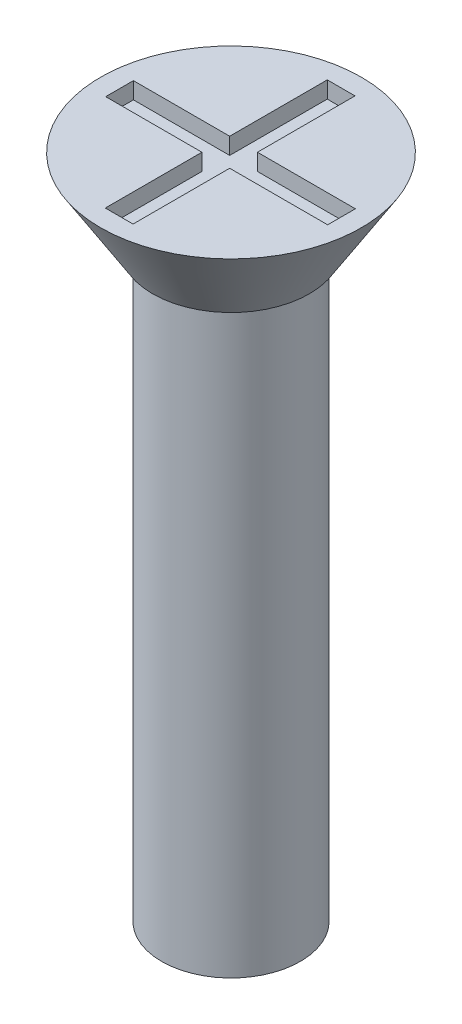
ISO-10303-21;
HEADER;
FILE_DESCRIPTION(('STEP AP214'),'2;1');
FILE_NAME('part.step','',(''),(''),'','','');
FILE_SCHEMA(('AUTOMOTIVE_DESIGN { 1 0 10303 214 1 1 1 1 }'));
ENDSEC;
DATA;
#1=APPLICATION_CONTEXT('core data for automotive mechanical design processes');
#2=APPLICATION_PROTOCOL_DEFINITION('international standard','automotive_design',2000,#1);
#3=PRODUCT_CONTEXT('',#1,'mechanical');
#4=PRODUCT('Part','Part','',(#3));
#5=PRODUCT_RELATED_PRODUCT_CATEGORY('part','',(#4));
#6=PRODUCT_DEFINITION_FORMATION('','',#4);
#7=PRODUCT_DEFINITION_CONTEXT('part definition',#1,'design');
#8=PRODUCT_DEFINITION('design','',#6,#7);
#9=PRODUCT_DEFINITION_SHAPE('','',#8);
#10=(LENGTH_UNIT() NAMED_UNIT(*) SI_UNIT(.MILLI.,.METRE.));
#11=(NAMED_UNIT(*) PLANE_ANGLE_UNIT() SI_UNIT($,.RADIAN.));
#12=(NAMED_UNIT(*) SI_UNIT($,.STERADIAN.) SOLID_ANGLE_UNIT());
#13=UNCERTAINTY_MEASURE_WITH_UNIT(LENGTH_MEASURE(1.E-05),#10,'distance_accuracy_value','');
#14=(GEOMETRIC_REPRESENTATION_CONTEXT(3) GLOBAL_UNCERTAINTY_ASSIGNED_CONTEXT((#13)) GLOBAL_UNIT_ASSIGNED_CONTEXT((#10,
#11,#12)) REPRESENTATION_CONTEXT('',''));
#15=CARTESIAN_POINT('',(0.,0.,0.));
#16=DIRECTION('',(0.,0.,1.));
#17=DIRECTION('',(1.,0.,0.));
#18=AXIS2_PLACEMENT_3D('',#15,#16,#17);
#19=CARTESIAN_POINT('',(0.,12.,0.));
#20=DIRECTION('',(0.,1.,0.));
#21=DIRECTION('',(0.,0.,1.));
#22=AXIS2_PLACEMENT_3D('',#19,#20,#21);
#23=PLANE('',#22);
#24=CARTESIAN_POINT('',(0.,12.,0.));
#25=DIRECTION('',(0.,1.,0.));
#26=DIRECTION('',(0.,0.,1.));
#27=AXIS2_PLACEMENT_3D('',#24,#25,#26);
#28=CIRCLE('',#27,2.35);
#29=CARTESIAN_POINT('',(0.,12.,2.35));
#30=VERTEX_POINT('',#29);
#31=EDGE_CURVE('E192',#30,#30,#28,.T.);
#32=ORIENTED_EDGE('',*,*,#31,.T.);
#33=EDGE_LOOP('',(#32));
#34=FACE_BOUND('',#33,.T.);
#35=DIRECTION('',(1.,0.,0.));
#36=VECTOR('',#35,1.);
#37=CARTESIAN_POINT('',(0.,12.,-2.));
#38=LINE('',#37,#36);
#39=CARTESIAN_POINT('',(-0.265272843023468,12.,-2.));
#40=VERTEX_POINT('',#39);
#41=CARTESIAN_POINT('',(0.234727156976532,12.,-2.));
#42=VERTEX_POINT('',#41);
#43=EDGE_CURVE('E161',#40,#42,#38,.T.);
#44=ORIENTED_EDGE('',*,*,#43,.T.);
#45=DIRECTION('',(0.,0.,1.));
#46=VECTOR('',#45,1.);
#47=CARTESIAN_POINT('',(0.234727156976532,12.,0.));
#48=LINE('',#47,#46);
#49=CARTESIAN_POINT('',(0.234727156976532,12.,-0.241621514992573));
#50=VERTEX_POINT('',#49);
#51=EDGE_CURVE('E48',#42,#50,#48,.T.);
#52=ORIENTED_EDGE('',*,*,#51,.T.);
#53=DIRECTION('',(1.,0.,0.));
#54=VECTOR('',#53,1.);
#55=CARTESIAN_POINT('',(0.,12.,-0.241621514992573));
#56=LINE('',#55,#54);
#57=CARTESIAN_POINT('',(2.,12.,-0.241621514992573));
#58=VERTEX_POINT('',#57);
#59=EDGE_CURVE('E98',#50,#58,#56,.T.);
#60=ORIENTED_EDGE('',*,*,#59,.T.);
#61=DIRECTION('',(0.,0.,1.));
#62=VECTOR('',#61,1.);
#63=CARTESIAN_POINT('',(2.,12.,0.));
#64=LINE('',#63,#62);
#65=CARTESIAN_POINT('',(2.,12.,0.258378485007427));
#66=VERTEX_POINT('',#65);
#67=EDGE_CURVE('E186',#58,#66,#64,.T.);
#68=ORIENTED_EDGE('',*,*,#67,.T.);
#69=DIRECTION('',(1.,0.,0.));
#70=VECTOR('',#69,1.);
#71=CARTESIAN_POINT('',(0.,12.,0.258378485007427));
#72=LINE('',#71,#70);
#73=CARTESIAN_POINT('',(0.234727156976532,12.,0.258378485007427));
#74=VERTEX_POINT('',#73);
#75=EDGE_CURVE('E145',#74,#66,#72,.T.);
#76=ORIENTED_EDGE('',*,*,#75,.F.);
#77=DIRECTION('',(0.,0.,1.));
#78=VECTOR('',#77,1.);
#79=CARTESIAN_POINT('',(0.234727156976532,12.,0.));
#80=LINE('',#79,#78);
#81=CARTESIAN_POINT('',(0.234727156976533,12.,2.));
#82=VERTEX_POINT('',#81);
#83=EDGE_CURVE('E182',#74,#82,#80,.T.);
#84=ORIENTED_EDGE('',*,*,#83,.T.);
#85=DIRECTION('',(1.,0.,0.));
#86=VECTOR('',#85,1.);
#87=CARTESIAN_POINT('',(0.,12.,2.));
#88=LINE('',#87,#86);
#89=CARTESIAN_POINT('',(-0.265272843023467,12.,2.));
#90=VERTEX_POINT('',#89);
#91=EDGE_CURVE('E179',#90,#82,#88,.T.);
#92=ORIENTED_EDGE('',*,*,#91,.F.);
#93=DIRECTION('',(0.,0.,1.));
#94=VECTOR('',#93,1.);
#95=CARTESIAN_POINT('',(-0.265272843023468,12.,0.));
#96=LINE('',#95,#94);
#97=CARTESIAN_POINT('',(-0.265272843023468,12.,0.258378485007427));
#98=VERTEX_POINT('',#97);
#99=EDGE_CURVE('E176',#98,#90,#96,.T.);
#100=ORIENTED_EDGE('',*,*,#99,.F.);
#101=DIRECTION('',(1.,0.,0.));
#102=VECTOR('',#101,1.);
#103=CARTESIAN_POINT('',(0.,12.,0.258378485007427));
#104=LINE('',#103,#102);
#105=CARTESIAN_POINT('',(-2.,12.,0.258378485007427));
#106=VERTEX_POINT('',#105);
#107=EDGE_CURVE('E173',#106,#98,#104,.T.);
#108=ORIENTED_EDGE('',*,*,#107,.F.);
#109=DIRECTION('',(0.,0.,1.));
#110=VECTOR('',#109,1.);
#111=CARTESIAN_POINT('',(-2.,12.,0.));
#112=LINE('',#111,#110);
#113=CARTESIAN_POINT('',(-2.,12.,-0.241621514992573));
#114=VERTEX_POINT('',#113);
#115=EDGE_CURVE('E170',#114,#106,#112,.T.);
#116=ORIENTED_EDGE('',*,*,#115,.F.);
#117=DIRECTION('',(1.,0.,0.));
#118=VECTOR('',#117,1.);
#119=CARTESIAN_POINT('',(0.,12.,-0.241621514992573));
#120=LINE('',#119,#118);
#121=CARTESIAN_POINT('',(-0.265272843023468,12.,-0.241621514992573));
#122=VERTEX_POINT('',#121);
#123=EDGE_CURVE('E167',#114,#122,#120,.T.);
#124=ORIENTED_EDGE('',*,*,#123,.T.);
#125=DIRECTION('',(0.,0.,1.));
#126=VECTOR('',#125,1.);
#127=CARTESIAN_POINT('',(-0.265272843023468,12.,0.));
#128=LINE('',#127,#126);
#129=EDGE_CURVE('E164',#40,#122,#128,.T.);
#130=ORIENTED_EDGE('',*,*,#129,.F.);
#131=EDGE_LOOP('',(#44,#52,#60,#68,#76,#84,#92,#100,#108,#116,#124,#130));
#132=FACE_BOUND('',#131,.T.);
#133=ADVANCED_FACE('F33',(#34,#132),#23,.T.);
#134=CARTESIAN_POINT('',(0.,12.,0.));
#135=DIRECTION('',(0.,-1.,0.));
#136=DIRECTION('',(0.,0.,-1.));
#137=AXIS2_PLACEMENT_3D('',#134,#135,#136);
#138=CYLINDRICAL_SURFACE('',#137,1.25);
#139=CARTESIAN_POINT('',(0.,0.,0.));
#140=DIRECTION('',(0.,1.,0.));
#141=DIRECTION('',(0.,0.,1.));
#142=AXIS2_PLACEMENT_3D('',#139,#140,#141);
#143=CIRCLE('',#142,1.25);
#144=CARTESIAN_POINT('',(0.,0.,1.25));
#145=VERTEX_POINT('',#144);
#146=EDGE_CURVE('E41',#145,#145,#143,.T.);
#147=ORIENTED_EDGE('',*,*,#146,.T.);
#148=EDGE_LOOP('',(#147));
#149=FACE_BOUND('',#148,.T.);
#150=CARTESIAN_POINT('',(0.,10.5,0.));
#151=DIRECTION('',(0.,1.,0.));
#152=DIRECTION('',(0.,0.,1.));
#153=AXIS2_PLACEMENT_3D('',#150,#151,#152);
#154=CIRCLE('',#153,1.25);
#155=CARTESIAN_POINT('',(0.,10.5,1.25));
#156=VERTEX_POINT('',#155);
#157=EDGE_CURVE('E11',#156,#156,#154,.T.);
#158=ORIENTED_EDGE('',*,*,#157,.F.);
#159=EDGE_LOOP('',(#158));
#160=FACE_BOUND('',#159,.T.);
#161=ADVANCED_FACE('F35',(#149,#160),#138,.T.);
#162=CARTESIAN_POINT('',(0.,0.,0.));
#163=DIRECTION('',(0.,1.,0.));
#164=DIRECTION('',(0.,0.,1.));
#165=AXIS2_PLACEMENT_3D('',#162,#163,#164);
#166=PLANE('',#165);
#167=ORIENTED_EDGE('',*,*,#146,.F.);
#168=EDGE_LOOP('',(#167));
#169=FACE_BOUND('',#168,.T.);
#170=ADVANCED_FACE('F219',(#169),#166,.F.);
#171=CARTESIAN_POINT('',(0.,12.,0.));
#172=DIRECTION('',(0.,1.,0.));
#173=DIRECTION('',(0.,0.,1.));
#174=AXIS2_PLACEMENT_3D('',#171,#172,#173);
#175=CONICAL_SURFACE('',#174,2.35,0.558505360638187);
#176=CARTESIAN_POINT('',(0.,10.5,0.));
#177=DIRECTION('',(0.,1.,0.));
#178=DIRECTION('',(0.,0.,1.));
#179=AXIS2_PLACEMENT_3D('',#176,#177,#178);
#180=CIRCLE('',#179,1.41269597213601);
#181=CARTESIAN_POINT('',(0.,10.5,1.41269597213601));
#182=VERTEX_POINT('',#181);
#183=EDGE_CURVE('E212',#182,#182,#180,.T.);
#184=ORIENTED_EDGE('',*,*,#183,.T.);
#185=EDGE_LOOP('',(#184));
#186=FACE_BOUND('',#185,.T.);
#187=ORIENTED_EDGE('',*,*,#31,.F.);
#188=EDGE_LOOP('',(#187));
#189=FACE_BOUND('',#188,.T.);
#190=ADVANCED_FACE('F221',(#186,#189),#175,.T.);
#191=CARTESIAN_POINT('',(0.,10.5,0.));
#192=DIRECTION('',(0.,1.,0.));
#193=DIRECTION('',(0.,0.,1.));
#194=AXIS2_PLACEMENT_3D('',#191,#192,#193);
#195=PLANE('',#194);
#196=ORIENTED_EDGE('',*,*,#157,.T.);
#197=EDGE_LOOP('',(#196));
#198=FACE_BOUND('',#197,.T.);
#199=ORIENTED_EDGE('',*,*,#183,.F.);
#200=EDGE_LOOP('',(#199));
#201=FACE_BOUND('',#200,.T.);
#202=ADVANCED_FACE('F226',(#198,#201),#195,.F.);
#203=CARTESIAN_POINT('',(0.234727156976532,11.7,0.));
#204=DIRECTION('',(-1.,0.,0.));
#205=DIRECTION('',(0.,0.,1.));
#206=AXIS2_PLACEMENT_3D('',#203,#204,#205);
#207=PLANE('',#206);
#208=ORIENTED_EDGE('',*,*,#51,.F.);
#209=DIRECTION('',(0.,1.,0.));
#210=VECTOR('',#209,1.);
#211=CARTESIAN_POINT('',(0.234727156976532,11.7,-2.));
#212=LINE('',#211,#210);
#213=CARTESIAN_POINT('',(0.234727156976532,11.7,-2.));
#214=VERTEX_POINT('',#213);
#215=EDGE_CURVE('E159',#214,#42,#212,.T.);
#216=ORIENTED_EDGE('',*,*,#215,.F.);
#217=DIRECTION('',(0.,0.,1.));
#218=VECTOR('',#217,1.);
#219=CARTESIAN_POINT('',(0.234727156976532,11.7,0.));
#220=LINE('',#219,#218);
#221=CARTESIAN_POINT('',(0.234727156976532,11.7,-0.241621514992573));
#222=VERTEX_POINT('',#221);
#223=EDGE_CURVE('E189',#214,#222,#220,.T.);
#224=ORIENTED_EDGE('',*,*,#223,.T.);
#225=DIRECTION('',(0.,1.,0.));
#226=VECTOR('',#225,1.);
#227=CARTESIAN_POINT('',(0.234727156976532,11.7,-0.241621514992573));
#228=LINE('',#227,#226);
#229=EDGE_CURVE('E190',#222,#50,#228,.T.);
#230=ORIENTED_EDGE('',*,*,#229,.T.);
#231=EDGE_LOOP('',(#208,#216,#224,#230));
#232=FACE_BOUND('',#231,.T.);
#233=ADVANCED_FACE('F238',(#232),#207,.T.);
#234=CARTESIAN_POINT('',(0.,11.7,-0.241621514992573));
#235=DIRECTION('',(0.,0.,1.));
#236=DIRECTION('',(1.,0.,0.));
#237=AXIS2_PLACEMENT_3D('',#234,#235,#236);
#238=PLANE('',#237);
#239=ORIENTED_EDGE('',*,*,#59,.F.);
#240=ORIENTED_EDGE('',*,*,#229,.F.);
#241=DIRECTION('',(1.,0.,0.));
#242=VECTOR('',#241,1.);
#243=CARTESIAN_POINT('',(0.,11.7,-0.241621514992573));
#244=LINE('',#243,#242);
#245=CARTESIAN_POINT('',(2.,11.7,-0.241621514992573));
#246=VERTEX_POINT('',#245);
#247=EDGE_CURVE('E57',#222,#246,#244,.T.);
#248=ORIENTED_EDGE('',*,*,#247,.T.);
#249=DIRECTION('',(0.,1.,0.));
#250=VECTOR('',#249,1.);
#251=CARTESIAN_POINT('',(2.,11.7,-0.241621514992573));
#252=LINE('',#251,#250);
#253=EDGE_CURVE('E137',#246,#58,#252,.T.);
#254=ORIENTED_EDGE('',*,*,#253,.T.);
#255=EDGE_LOOP('',(#239,#240,#248,#254));
#256=FACE_BOUND('',#255,.T.);
#257=ADVANCED_FACE('F242',(#256),#238,.T.);
#258=CARTESIAN_POINT('',(2.,11.7,0.));
#259=DIRECTION('',(-1.,0.,0.));
#260=DIRECTION('',(0.,0.,1.));
#261=AXIS2_PLACEMENT_3D('',#258,#259,#260);
#262=PLANE('',#261);
#263=ORIENTED_EDGE('',*,*,#67,.F.);
#264=ORIENTED_EDGE('',*,*,#253,.F.);
#265=DIRECTION('',(0.,0.,1.));
#266=VECTOR('',#265,1.);
#267=CARTESIAN_POINT('',(2.,11.7,0.));
#268=LINE('',#267,#266);
#269=CARTESIAN_POINT('',(2.,11.7,0.258378485007427));
#270=VERTEX_POINT('',#269);
#271=EDGE_CURVE('E131',#246,#270,#268,.T.);
#272=ORIENTED_EDGE('',*,*,#271,.T.);
#273=DIRECTION('',(0.,1.,0.));
#274=VECTOR('',#273,1.);
#275=CARTESIAN_POINT('',(2.,11.7,0.258378485007427));
#276=LINE('',#275,#274);
#277=EDGE_CURVE('E135',#270,#66,#276,.T.);
#278=ORIENTED_EDGE('',*,*,#277,.T.);
#279=EDGE_LOOP('',(#263,#264,#272,#278));
#280=FACE_BOUND('',#279,.T.);
#281=ADVANCED_FACE('F134',(#280),#262,.T.);
#282=CARTESIAN_POINT('',(0.,11.7,0.258378485007427));
#283=DIRECTION('',(0.,0.,1.));
#284=DIRECTION('',(1.,0.,0.));
#285=AXIS2_PLACEMENT_3D('',#282,#283,#284);
#286=PLANE('',#285);
#287=ORIENTED_EDGE('',*,*,#75,.T.);
#288=ORIENTED_EDGE('',*,*,#277,.F.);
#289=DIRECTION('',(1.,0.,0.));
#290=VECTOR('',#289,1.);
#291=CARTESIAN_POINT('',(0.,11.7,0.258378485007427));
#292=LINE('',#291,#290);
#293=CARTESIAN_POINT('',(0.234727156976532,11.7,0.258378485007427));
#294=VERTEX_POINT('',#293);
#295=EDGE_CURVE('E139',#294,#270,#292,.T.);
#296=ORIENTED_EDGE('',*,*,#295,.F.);
#297=DIRECTION('',(0.,1.,0.));
#298=VECTOR('',#297,1.);
#299=CARTESIAN_POINT('',(0.234727156976532,11.7,0.258378485007427));
#300=LINE('',#299,#298);
#301=EDGE_CURVE('E147',#294,#74,#300,.T.);
#302=ORIENTED_EDGE('',*,*,#301,.T.);
#303=EDGE_LOOP('',(#287,#288,#296,#302));
#304=FACE_BOUND('',#303,.T.);
#305=ADVANCED_FACE('F143',(#304),#286,.F.);
#306=CARTESIAN_POINT('',(0.234727156976532,11.7,0.));
#307=DIRECTION('',(-1.,0.,0.));
#308=DIRECTION('',(0.,0.,1.));
#309=AXIS2_PLACEMENT_3D('',#306,#307,#308);
#310=PLANE('',#309);
#311=ORIENTED_EDGE('',*,*,#83,.F.);
#312=ORIENTED_EDGE('',*,*,#301,.F.);
#313=DIRECTION('',(0.,0.,1.));
#314=VECTOR('',#313,1.);
#315=CARTESIAN_POINT('',(0.234727156976532,11.7,0.));
#316=LINE('',#315,#314);
#317=CARTESIAN_POINT('',(0.234727156976533,11.7,2.));
#318=VERTEX_POINT('',#317);
#319=EDGE_CURVE('E152',#294,#318,#316,.T.);
#320=ORIENTED_EDGE('',*,*,#319,.T.);
#321=DIRECTION('',(0.,1.,0.));
#322=VECTOR('',#321,1.);
#323=CARTESIAN_POINT('',(0.234727156976533,11.7,2.));
#324=LINE('',#323,#322);
#325=EDGE_CURVE('E195',#318,#82,#324,.T.);
#326=ORIENTED_EDGE('',*,*,#325,.T.);
#327=EDGE_LOOP('',(#311,#312,#320,#326));
#328=FACE_BOUND('',#327,.T.);
#329=ADVANCED_FACE('F269',(#328),#310,.T.);
#330=CARTESIAN_POINT('',(0.,11.7,2.));
#331=DIRECTION('',(0.,0.,1.));
#332=DIRECTION('',(1.,0.,0.));
#333=AXIS2_PLACEMENT_3D('',#330,#331,#332);
#334=PLANE('',#333);
#335=ORIENTED_EDGE('',*,*,#91,.T.);
#336=ORIENTED_EDGE('',*,*,#325,.F.);
#337=DIRECTION('',(1.,0.,0.));
#338=VECTOR('',#337,1.);
#339=CARTESIAN_POINT('',(0.,11.7,2.));
#340=LINE('',#339,#338);
#341=CARTESIAN_POINT('',(-0.265272843023467,11.7,2.));
#342=VERTEX_POINT('',#341);
#343=EDGE_CURVE('E154',#342,#318,#340,.T.);
#344=ORIENTED_EDGE('',*,*,#343,.F.);
#345=DIRECTION('',(0.,1.,0.));
#346=VECTOR('',#345,1.);
#347=CARTESIAN_POINT('',(-0.265272843023467,11.7,2.));
#348=LINE('',#347,#346);
#349=EDGE_CURVE('E197',#342,#90,#348,.T.);
#350=ORIENTED_EDGE('',*,*,#349,.T.);
#351=EDGE_LOOP('',(#335,#336,#344,#350));
#352=FACE_BOUND('',#351,.T.);
#353=ADVANCED_FACE('F265',(#352),#334,.F.);
#354=CARTESIAN_POINT('',(-0.265272843023468,11.7,0.));
#355=DIRECTION('',(-1.,0.,0.));
#356=DIRECTION('',(0.,0.,1.));
#357=AXIS2_PLACEMENT_3D('',#354,#355,#356);
#358=PLANE('',#357);
#359=ORIENTED_EDGE('',*,*,#99,.T.);
#360=ORIENTED_EDGE('',*,*,#349,.F.);
#361=DIRECTION('',(0.,0.,1.));
#362=VECTOR('',#361,1.);
#363=CARTESIAN_POINT('',(-0.265272843023468,11.7,0.));
#364=LINE('',#363,#362);
#365=CARTESIAN_POINT('',(-0.265272843023468,11.7,0.258378485007427));
#366=VERTEX_POINT('',#365);
#367=EDGE_CURVE('E417',#366,#342,#364,.T.);
#368=ORIENTED_EDGE('',*,*,#367,.F.);
#369=DIRECTION('',(0.,1.,0.));
#370=VECTOR('',#369,1.);
#371=CARTESIAN_POINT('',(-0.265272843023468,11.7,0.258378485007427));
#372=LINE('',#371,#370);
#373=EDGE_CURVE('E199',#366,#98,#372,.T.);
#374=ORIENTED_EDGE('',*,*,#373,.T.);
#375=EDGE_LOOP('',(#359,#360,#368,#374));
#376=FACE_BOUND('',#375,.T.);
#377=ADVANCED_FACE('F261',(#376),#358,.F.);
#378=CARTESIAN_POINT('',(0.,11.7,0.258378485007427));
#379=DIRECTION('',(0.,0.,1.));
#380=DIRECTION('',(1.,0.,0.));
#381=AXIS2_PLACEMENT_3D('',#378,#379,#380);
#382=PLANE('',#381);
#383=ORIENTED_EDGE('',*,*,#107,.T.);
#384=ORIENTED_EDGE('',*,*,#373,.F.);
#385=DIRECTION('',(1.,0.,0.));
#386=VECTOR('',#385,1.);
#387=CARTESIAN_POINT('',(0.,11.7,0.258378485007427));
#388=LINE('',#387,#386);
#389=CARTESIAN_POINT('',(-2.,11.7,0.258378485007427));
#390=VERTEX_POINT('',#389);
#391=EDGE_CURVE('E414',#390,#366,#388,.T.);
#392=ORIENTED_EDGE('',*,*,#391,.F.);
#393=DIRECTION('',(0.,1.,0.));
#394=VECTOR('',#393,1.);
#395=CARTESIAN_POINT('',(-2.,11.7,0.258378485007427));
#396=LINE('',#395,#394);
#397=EDGE_CURVE('E201',#390,#106,#396,.T.);
#398=ORIENTED_EDGE('',*,*,#397,.T.);
#399=EDGE_LOOP('',(#383,#384,#392,#398));
#400=FACE_BOUND('',#399,.T.);
#401=ADVANCED_FACE('F257',(#400),#382,.F.);
#402=CARTESIAN_POINT('',(-2.,11.7,0.));
#403=DIRECTION('',(-1.,0.,0.));
#404=DIRECTION('',(0.,0.,1.));
#405=AXIS2_PLACEMENT_3D('',#402,#403,#404);
#406=PLANE('',#405);
#407=ORIENTED_EDGE('',*,*,#115,.T.);
#408=ORIENTED_EDGE('',*,*,#397,.F.);
#409=DIRECTION('',(0.,0.,1.));
#410=VECTOR('',#409,1.);
#411=CARTESIAN_POINT('',(-2.,11.7,0.));
#412=LINE('',#411,#410);
#413=CARTESIAN_POINT('',(-2.,11.7,-0.241621514992573));
#414=VERTEX_POINT('',#413);
#415=EDGE_CURVE('E411',#414,#390,#412,.T.);
#416=ORIENTED_EDGE('',*,*,#415,.F.);
#417=DIRECTION('',(0.,1.,0.));
#418=VECTOR('',#417,1.);
#419=CARTESIAN_POINT('',(-2.,11.7,-0.241621514992573));
#420=LINE('',#419,#418);
#421=EDGE_CURVE('E203',#414,#114,#420,.T.);
#422=ORIENTED_EDGE('',*,*,#421,.T.);
#423=EDGE_LOOP('',(#407,#408,#416,#422));
#424=FACE_BOUND('',#423,.T.);
#425=ADVANCED_FACE('F253',(#424),#406,.F.);
#426=CARTESIAN_POINT('',(0.,11.7,-0.241621514992573));
#427=DIRECTION('',(0.,0.,1.));
#428=DIRECTION('',(1.,0.,0.));
#429=AXIS2_PLACEMENT_3D('',#426,#427,#428);
#430=PLANE('',#429);
#431=ORIENTED_EDGE('',*,*,#123,.F.);
#432=ORIENTED_EDGE('',*,*,#421,.F.);
#433=DIRECTION('',(1.,0.,0.));
#434=VECTOR('',#433,1.);
#435=CARTESIAN_POINT('',(0.,11.7,-0.241621514992573));
#436=LINE('',#435,#434);
#437=CARTESIAN_POINT('',(-0.265272843023468,11.7,-0.241621514992573));
#438=VERTEX_POINT('',#437);
#439=EDGE_CURVE('E409',#414,#438,#436,.T.);
#440=ORIENTED_EDGE('',*,*,#439,.T.);
#441=DIRECTION('',(0.,1.,0.));
#442=VECTOR('',#441,1.);
#443=CARTESIAN_POINT('',(-0.265272843023468,11.7,-0.241621514992573));
#444=LINE('',#443,#442);
#445=EDGE_CURVE('E205',#438,#122,#444,.T.);
#446=ORIENTED_EDGE('',*,*,#445,.T.);
#447=EDGE_LOOP('',(#431,#432,#440,#446));
#448=FACE_BOUND('',#447,.T.);
#449=ADVANCED_FACE('F249',(#448),#430,.T.);
#450=CARTESIAN_POINT('',(-0.265272843023468,11.7,0.));
#451=DIRECTION('',(-1.,0.,0.));
#452=DIRECTION('',(0.,0.,1.));
#453=AXIS2_PLACEMENT_3D('',#450,#451,#452);
#454=PLANE('',#453);
#455=ORIENTED_EDGE('',*,*,#129,.T.);
#456=ORIENTED_EDGE('',*,*,#445,.F.);
#457=DIRECTION('',(0.,0.,1.));
#458=VECTOR('',#457,1.);
#459=CARTESIAN_POINT('',(-0.265272843023468,11.7,0.));
#460=LINE('',#459,#458);
#461=CARTESIAN_POINT('',(-0.265272843023468,11.7,-2.));
#462=VERTEX_POINT('',#461);
#463=EDGE_CURVE('E405',#462,#438,#460,.T.);
#464=ORIENTED_EDGE('',*,*,#463,.F.);
#465=DIRECTION('',(0.,1.,0.));
#466=VECTOR('',#465,1.);
#467=CARTESIAN_POINT('',(-0.265272843023468,11.7,-2.));
#468=LINE('',#467,#466);
#469=EDGE_CURVE('E207',#462,#40,#468,.T.);
#470=ORIENTED_EDGE('',*,*,#469,.T.);
#471=EDGE_LOOP('',(#455,#456,#464,#470));
#472=FACE_BOUND('',#471,.T.);
#473=ADVANCED_FACE('F246',(#472),#454,.F.);
#474=CARTESIAN_POINT('',(0.,11.7,-2.));
#475=DIRECTION('',(0.,0.,1.));
#476=DIRECTION('',(1.,0.,0.));
#477=AXIS2_PLACEMENT_3D('',#474,#475,#476);
#478=PLANE('',#477);
#479=ORIENTED_EDGE('',*,*,#43,.F.);
#480=ORIENTED_EDGE('',*,*,#469,.F.);
#481=DIRECTION('',(1.,0.,0.));
#482=VECTOR('',#481,1.);
#483=CARTESIAN_POINT('',(0.,11.7,-2.));
#484=LINE('',#483,#482);
#485=EDGE_CURVE('E105',#462,#214,#484,.T.);
#486=ORIENTED_EDGE('',*,*,#485,.T.);
#487=ORIENTED_EDGE('',*,*,#215,.T.);
#488=EDGE_LOOP('',(#479,#480,#486,#487));
#489=FACE_BOUND('',#488,.T.);
#490=ADVANCED_FACE('F243',(#489),#478,.T.);
#491=CARTESIAN_POINT('',(0.,11.7,0.));
#492=DIRECTION('',(0.,1.,0.));
#493=DIRECTION('',(0.,0.,1.));
#494=AXIS2_PLACEMENT_3D('',#491,#492,#493);
#495=PLANE('',#494);
#496=ORIENTED_EDGE('',*,*,#223,.F.);
#497=ORIENTED_EDGE('',*,*,#485,.F.);
#498=ORIENTED_EDGE('',*,*,#463,.T.);
#499=ORIENTED_EDGE('',*,*,#439,.F.);
#500=ORIENTED_EDGE('',*,*,#415,.T.);
#501=ORIENTED_EDGE('',*,*,#391,.T.);
#502=ORIENTED_EDGE('',*,*,#367,.T.);
#503=ORIENTED_EDGE('',*,*,#343,.T.);
#504=ORIENTED_EDGE('',*,*,#319,.F.);
#505=ORIENTED_EDGE('',*,*,#295,.T.);
#506=ORIENTED_EDGE('',*,*,#271,.F.);
#507=ORIENTED_EDGE('',*,*,#247,.F.);
#508=EDGE_LOOP('',(#496,#497,#498,#499,#500,#501,#502,#503,#504,#505,#506,#507));
#509=FACE_BOUND('',#508,.T.);
#510=ADVANCED_FACE('F150',(#509),#495,.T.);
#511=CLOSED_SHELL('',(#133,#161,#170,#190,#202,#233,#257,#281,#305,#329,#353,#377,#401,#425,
#449,#473,#490,#510));
#512=MANIFOLD_SOLID_BREP('B2',#511);
#513=ADVANCED_BREP_SHAPE_REPRESENTATION('',(#18,#512),#14);
#514=SHAPE_DEFINITION_REPRESENTATION(#9,#513);
ENDSEC;
END-ISO-10303-21;
